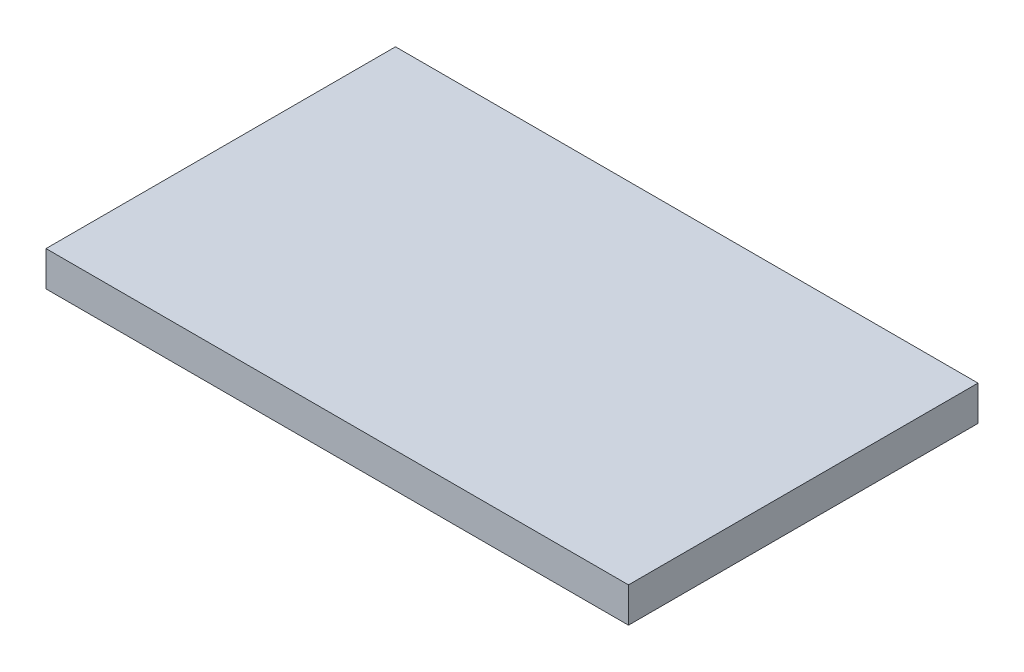
ISO-10303-21;
HEADER;
FILE_DESCRIPTION(('STEP AP214'),'2;1');
FILE_NAME('part.step','',(''),(''),'','','');
FILE_SCHEMA(('AUTOMOTIVE_DESIGN { 1 0 10303 214 1 1 1 1 }'));
ENDSEC;
DATA;
#1=APPLICATION_CONTEXT('core data for automotive mechanical design processes');
#2=APPLICATION_PROTOCOL_DEFINITION('international standard','automotive_design',2000,#1);
#3=PRODUCT_CONTEXT('',#1,'mechanical');
#4=PRODUCT('Part','Part','',(#3));
#5=PRODUCT_RELATED_PRODUCT_CATEGORY('part','',(#4));
#6=PRODUCT_DEFINITION_FORMATION('','',#4);
#7=PRODUCT_DEFINITION_CONTEXT('part definition',#1,'design');
#8=PRODUCT_DEFINITION('design','',#6,#7);
#9=PRODUCT_DEFINITION_SHAPE('','',#8);
#10=(LENGTH_UNIT() NAMED_UNIT(*) SI_UNIT(.MILLI.,.METRE.));
#11=(NAMED_UNIT(*) PLANE_ANGLE_UNIT() SI_UNIT($,.RADIAN.));
#12=(NAMED_UNIT(*) SI_UNIT($,.STERADIAN.) SOLID_ANGLE_UNIT());
#13=UNCERTAINTY_MEASURE_WITH_UNIT(LENGTH_MEASURE(1.E-05),#10,'distance_accuracy_value','');
#14=(GEOMETRIC_REPRESENTATION_CONTEXT(3) GLOBAL_UNCERTAINTY_ASSIGNED_CONTEXT((#13)) GLOBAL_UNIT_ASSIGNED_CONTEXT((#10,
#11,#12)) REPRESENTATION_CONTEXT('',''));
#15=CARTESIAN_POINT('',(0.,0.,0.));
#16=DIRECTION('',(0.,0.,1.));
#17=DIRECTION('',(1.,0.,0.));
#18=AXIS2_PLACEMENT_3D('',#15,#16,#17);
#19=CARTESIAN_POINT('',(0.,0.6,0.));
#20=DIRECTION('',(1.,0.,0.));
#21=DIRECTION('',(0.,0.,-1.));
#22=AXIS2_PLACEMENT_3D('',#19,#20,#21);
#23=PLANE('',#22);
#24=DIRECTION('',(0.,0.,1.));
#25=VECTOR('',#24,1.);
#26=CARTESIAN_POINT('',(0.,0.,0.));
#27=LINE('',#26,#25);
#28=CARTESIAN_POINT('',(0.,0.,-6.));
#29=VERTEX_POINT('',#28);
#30=CARTESIAN_POINT('',(0.,0.,0.));
#31=VERTEX_POINT('',#30);
#32=EDGE_CURVE('E96',#29,#31,#27,.T.);
#33=ORIENTED_EDGE('',*,*,#32,.T.);
#34=DIRECTION('',(0.,-1.,0.));
#35=VECTOR('',#34,1.);
#36=CARTESIAN_POINT('',(0.,0.6,0.));
#37=LINE('',#36,#35);
#38=CARTESIAN_POINT('',(0.,0.6,0.));
#39=VERTEX_POINT('',#38);
#40=EDGE_CURVE('E11',#39,#31,#37,.T.);
#41=ORIENTED_EDGE('',*,*,#40,.F.);
#42=DIRECTION('',(0.,0.,1.));
#43=VECTOR('',#42,1.);
#44=CARTESIAN_POINT('',(0.,0.6,0.));
#45=LINE('',#44,#43);
#46=CARTESIAN_POINT('',(0.,0.6,-6.));
#47=VERTEX_POINT('',#46);
#48=EDGE_CURVE('E84',#47,#39,#45,.T.);
#49=ORIENTED_EDGE('',*,*,#48,.F.);
#50=DIRECTION('',(0.,-1.,0.));
#51=VECTOR('',#50,1.);
#52=CARTESIAN_POINT('',(0.,0.6,-6.));
#53=LINE('',#52,#51);
#54=EDGE_CURVE('E92',#47,#29,#53,.T.);
#55=ORIENTED_EDGE('',*,*,#54,.T.);
#56=EDGE_LOOP('',(#33,#41,#49,#55));
#57=FACE_BOUND('',#56,.T.);
#58=ADVANCED_FACE('F33',(#57),#23,.F.);
#59=CARTESIAN_POINT('',(0.,0.6,0.));
#60=DIRECTION('',(0.,0.,-1.));
#61=DIRECTION('',(-1.,0.,0.));
#62=AXIS2_PLACEMENT_3D('',#59,#60,#61);
#63=PLANE('',#62);
#64=DIRECTION('',(1.,0.,0.));
#65=VECTOR('',#64,1.);
#66=CARTESIAN_POINT('',(0.,0.,0.));
#67=LINE('',#66,#65);
#68=CARTESIAN_POINT('',(10.,0.,0.));
#69=VERTEX_POINT('',#68);
#70=EDGE_CURVE('E88',#31,#69,#67,.T.);
#71=ORIENTED_EDGE('',*,*,#70,.T.);
#72=DIRECTION('',(0.,-1.,0.));
#73=VECTOR('',#72,1.);
#74=CARTESIAN_POINT('',(10.,0.6,0.));
#75=LINE('',#74,#73);
#76=CARTESIAN_POINT('',(10.,0.6,0.));
#77=VERTEX_POINT('',#76);
#78=EDGE_CURVE('E41',#77,#69,#75,.T.);
#79=ORIENTED_EDGE('',*,*,#78,.F.);
#80=DIRECTION('',(1.,0.,0.));
#81=VECTOR('',#80,1.);
#82=CARTESIAN_POINT('',(0.,0.6,0.));
#83=LINE('',#82,#81);
#84=EDGE_CURVE('E79',#39,#77,#83,.T.);
#85=ORIENTED_EDGE('',*,*,#84,.F.);
#86=ORIENTED_EDGE('',*,*,#40,.T.);
#87=EDGE_LOOP('',(#71,#79,#85,#86));
#88=FACE_BOUND('',#87,.T.);
#89=ADVANCED_FACE('F87',(#88),#63,.F.);
#90=CARTESIAN_POINT('',(10.,0.6,0.));
#91=DIRECTION('',(-1.,0.,0.));
#92=DIRECTION('',(0.,0.,1.));
#93=AXIS2_PLACEMENT_3D('',#90,#91,#92);
#94=PLANE('',#93);
#95=DIRECTION('',(0.,0.,-1.));
#96=VECTOR('',#95,1.);
#97=CARTESIAN_POINT('',(10.,0.,0.));
#98=LINE('',#97,#96);
#99=CARTESIAN_POINT('',(10.,0.,-6.));
#100=VERTEX_POINT('',#99);
#101=EDGE_CURVE('E66',#69,#100,#98,.T.);
#102=ORIENTED_EDGE('',*,*,#101,.T.);
#103=DIRECTION('',(0.,-1.,0.));
#104=VECTOR('',#103,1.);
#105=CARTESIAN_POINT('',(10.,0.6,-6.));
#106=LINE('',#105,#104);
#107=CARTESIAN_POINT('',(10.,0.6,-6.));
#108=VERTEX_POINT('',#107);
#109=EDGE_CURVE('E89',#108,#100,#106,.T.);
#110=ORIENTED_EDGE('',*,*,#109,.F.);
#111=DIRECTION('',(0.,0.,-1.));
#112=VECTOR('',#111,1.);
#113=CARTESIAN_POINT('',(10.,0.6,0.));
#114=LINE('',#113,#112);
#115=EDGE_CURVE('E82',#77,#108,#114,.T.);
#116=ORIENTED_EDGE('',*,*,#115,.F.);
#117=ORIENTED_EDGE('',*,*,#78,.T.);
#118=EDGE_LOOP('',(#102,#110,#116,#117));
#119=FACE_BOUND('',#118,.T.);
#120=ADVANCED_FACE('F90',(#119),#94,.F.);
#121=CARTESIAN_POINT('',(0.,0.6,-6.));
#122=DIRECTION('',(0.,0.,1.));
#123=DIRECTION('',(1.,0.,0.));
#124=AXIS2_PLACEMENT_3D('',#121,#122,#123);
#125=PLANE('',#124);
#126=DIRECTION('',(-1.,0.,0.));
#127=VECTOR('',#126,1.);
#128=CARTESIAN_POINT('',(0.,0.,-6.));
#129=LINE('',#128,#127);
#130=EDGE_CURVE('E72',#100,#29,#129,.T.);
#131=ORIENTED_EDGE('',*,*,#130,.T.);
#132=ORIENTED_EDGE('',*,*,#54,.F.);
#133=DIRECTION('',(-1.,0.,0.));
#134=VECTOR('',#133,1.);
#135=CARTESIAN_POINT('',(0.,0.6,-6.));
#136=LINE('',#135,#134);
#137=EDGE_CURVE('E49',#108,#47,#136,.T.);
#138=ORIENTED_EDGE('',*,*,#137,.F.);
#139=ORIENTED_EDGE('',*,*,#109,.T.);
#140=EDGE_LOOP('',(#131,#132,#138,#139));
#141=FACE_BOUND('',#140,.T.);
#142=ADVANCED_FACE('F103',(#141),#125,.F.);
#143=CARTESIAN_POINT('',(0.,0.6,0.));
#144=DIRECTION('',(0.,-1.,0.));
#145=DIRECTION('',(0.,0.,-1.));
#146=AXIS2_PLACEMENT_3D('',#143,#144,#145);
#147=PLANE('',#146);
#148=ORIENTED_EDGE('',*,*,#48,.T.);
#149=ORIENTED_EDGE('',*,*,#84,.T.);
#150=ORIENTED_EDGE('',*,*,#115,.T.);
#151=ORIENTED_EDGE('',*,*,#137,.T.);
#152=EDGE_LOOP('',(#148,#149,#150,#151));
#153=FACE_BOUND('',#152,.T.);
#154=ADVANCED_FACE('F80',(#153),#147,.F.);
#155=CARTESIAN_POINT('',(0.,0.,0.));
#156=DIRECTION('',(0.,-1.,0.));
#157=DIRECTION('',(0.,0.,-1.));
#158=AXIS2_PLACEMENT_3D('',#155,#156,#157);
#159=PLANE('',#158);
#160=ORIENTED_EDGE('',*,*,#32,.F.);
#161=ORIENTED_EDGE('',*,*,#130,.F.);
#162=ORIENTED_EDGE('',*,*,#101,.F.);
#163=ORIENTED_EDGE('',*,*,#70,.F.);
#164=EDGE_LOOP('',(#160,#161,#162,#163));
#165=FACE_BOUND('',#164,.T.);
#166=ADVANCED_FACE('F106',(#165),#159,.T.);
#167=CLOSED_SHELL('',(#58,#89,#120,#142,#154,#166));
#168=MANIFOLD_SOLID_BREP('B2',#167);
#169=ADVANCED_BREP_SHAPE_REPRESENTATION('',(#18,#168),#14);
#170=SHAPE_DEFINITION_REPRESENTATION(#9,#169);
ENDSEC;
END-ISO-10303-21;
